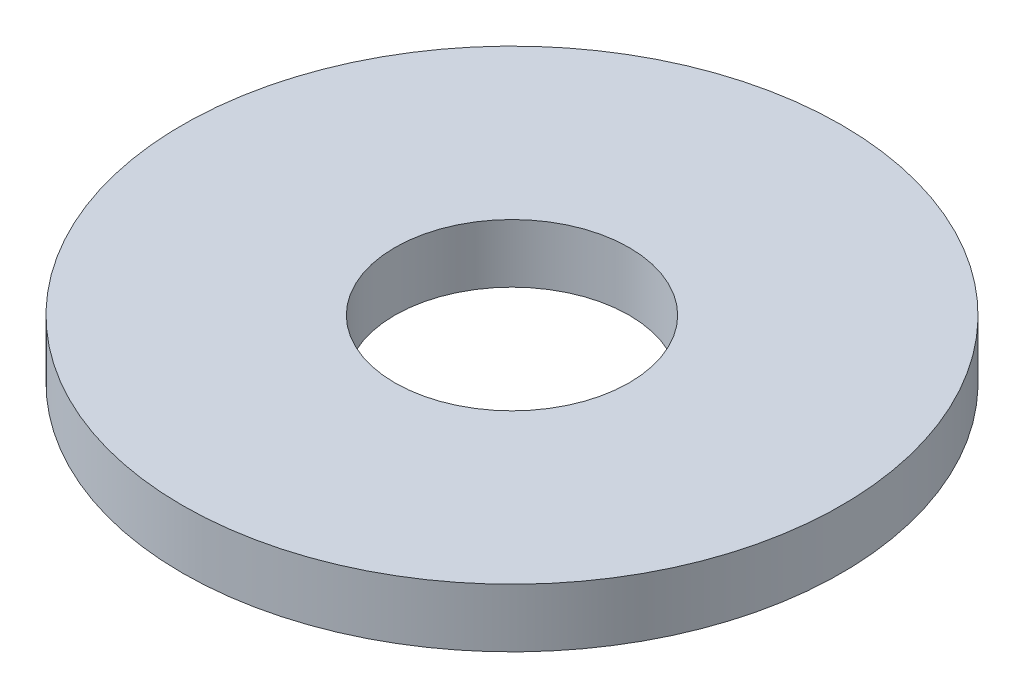
ISO-10303-21;
HEADER;
FILE_DESCRIPTION(('STEP AP214'),'2;1');
FILE_NAME('part.step','',(''),(''),'','','');
FILE_SCHEMA(('AUTOMOTIVE_DESIGN { 1 0 10303 214 1 1 1 1 }'));
ENDSEC;
DATA;
#1=APPLICATION_CONTEXT('core data for automotive mechanical design processes');
#2=APPLICATION_PROTOCOL_DEFINITION('international standard','automotive_design',2000,#1);
#3=PRODUCT_CONTEXT('',#1,'mechanical');
#4=PRODUCT('Part','Part','',(#3));
#5=PRODUCT_RELATED_PRODUCT_CATEGORY('part','',(#4));
#6=PRODUCT_DEFINITION_FORMATION('','',#4);
#7=PRODUCT_DEFINITION_CONTEXT('part definition',#1,'design');
#8=PRODUCT_DEFINITION('design','',#6,#7);
#9=PRODUCT_DEFINITION_SHAPE('','',#8);
#10=(LENGTH_UNIT() NAMED_UNIT(*) SI_UNIT(.MILLI.,.METRE.));
#11=(NAMED_UNIT(*) PLANE_ANGLE_UNIT() SI_UNIT($,.RADIAN.));
#12=(NAMED_UNIT(*) SI_UNIT($,.STERADIAN.) SOLID_ANGLE_UNIT());
#13=UNCERTAINTY_MEASURE_WITH_UNIT(LENGTH_MEASURE(1.E-05),#10,'distance_accuracy_value','');
#14=(GEOMETRIC_REPRESENTATION_CONTEXT(3) GLOBAL_UNCERTAINTY_ASSIGNED_CONTEXT((#13)) GLOBAL_UNIT_ASSIGNED_CONTEXT((#10,
#11,#12)) REPRESENTATION_CONTEXT('',''));
#15=CARTESIAN_POINT('',(0.,0.,0.));
#16=DIRECTION('',(0.,0.,1.));
#17=DIRECTION('',(1.,0.,0.));
#18=AXIS2_PLACEMENT_3D('',#15,#16,#17);
#19=CARTESIAN_POINT('',(0.,-0.8,0.));
#20=DIRECTION('',(0.,1.,0.));
#21=DIRECTION('',(0.,0.,1.));
#22=AXIS2_PLACEMENT_3D('',#19,#20,#21);
#23=PLANE('',#22);
#24=CARTESIAN_POINT('',(0.,-0.8,0.));
#25=DIRECTION('',(0.,-1.,0.));
#26=DIRECTION('',(0.,0.,-1.));
#27=AXIS2_PLACEMENT_3D('',#24,#25,#26);
#28=CIRCLE('',#27,3.2);
#29=CARTESIAN_POINT('',(0.,-0.8,-3.2));
#30=VERTEX_POINT('',#29);
#31=EDGE_CURVE('E27',#30,#30,#28,.F.);
#32=ORIENTED_EDGE('',*,*,#31,.T.);
#33=EDGE_LOOP('',(#32));
#34=FACE_BOUND('',#33,.T.);
#35=CARTESIAN_POINT('',(0.,-0.8,0.));
#36=DIRECTION('',(0.,-1.,0.));
#37=DIRECTION('',(0.,0.,-1.));
#38=AXIS2_PLACEMENT_3D('',#35,#36,#37);
#39=CIRCLE('',#38,9.);
#40=CARTESIAN_POINT('',(0.,-0.8,-9.));
#41=VERTEX_POINT('',#40);
#42=EDGE_CURVE('E18',#41,#41,#39,.F.);
#43=ORIENTED_EDGE('',*,*,#42,.F.);
#44=EDGE_LOOP('',(#43));
#45=FACE_BOUND('',#44,.T.);
#46=ADVANCED_FACE('F15',(#34,#45),#23,.F.);
#47=CARTESIAN_POINT('',(0.,0.8,0.));
#48=DIRECTION('',(0.,-1.,0.));
#49=DIRECTION('',(0.,0.,-1.));
#50=AXIS2_PLACEMENT_3D('',#47,#48,#49);
#51=CYLINDRICAL_SURFACE('',#50,9.);
#52=ORIENTED_EDGE('',*,*,#42,.T.);
#53=EDGE_LOOP('',(#52));
#54=FACE_BOUND('',#53,.T.);
#55=CARTESIAN_POINT('',(0.,0.8,0.));
#56=DIRECTION('',(0.,-1.,0.));
#57=DIRECTION('',(0.,0.,-1.));
#58=AXIS2_PLACEMENT_3D('',#55,#56,#57);
#59=CIRCLE('',#58,9.);
#60=CARTESIAN_POINT('',(0.,0.8,-9.));
#61=VERTEX_POINT('',#60);
#62=EDGE_CURVE('E22',#61,#61,#59,.F.);
#63=ORIENTED_EDGE('',*,*,#62,.F.);
#64=EDGE_LOOP('',(#63));
#65=FACE_BOUND('',#64,.T.);
#66=ADVANCED_FACE('F35',(#54,#65),#51,.T.);
#67=CARTESIAN_POINT('',(0.,0.8,0.));
#68=DIRECTION('',(0.,-1.,0.));
#69=DIRECTION('',(0.,0.,-1.));
#70=AXIS2_PLACEMENT_3D('',#67,#68,#69);
#71=CYLINDRICAL_SURFACE('',#70,3.2);
#72=CARTESIAN_POINT('',(0.,0.8,0.));
#73=DIRECTION('',(0.,-1.,0.));
#74=DIRECTION('',(0.,0.,-1.));
#75=AXIS2_PLACEMENT_3D('',#72,#73,#74);
#76=CIRCLE('',#75,3.2);
#77=CARTESIAN_POINT('',(0.,0.8,-3.2));
#78=VERTEX_POINT('',#77);
#79=EDGE_CURVE('E10',#78,#78,#76,.T.);
#80=ORIENTED_EDGE('',*,*,#79,.F.);
#81=EDGE_LOOP('',(#80));
#82=FACE_BOUND('',#81,.T.);
#83=ORIENTED_EDGE('',*,*,#31,.F.);
#84=EDGE_LOOP('',(#83));
#85=FACE_BOUND('',#84,.T.);
#86=ADVANCED_FACE('F43',(#82,#85),#71,.F.);
#87=CARTESIAN_POINT('',(0.,0.8,0.));
#88=DIRECTION('',(0.,1.,0.));
#89=DIRECTION('',(0.,0.,1.));
#90=AXIS2_PLACEMENT_3D('',#87,#88,#89);
#91=PLANE('',#90);
#92=ORIENTED_EDGE('',*,*,#79,.T.);
#93=EDGE_LOOP('',(#92));
#94=FACE_BOUND('',#93,.T.);
#95=ORIENTED_EDGE('',*,*,#62,.T.);
#96=EDGE_LOOP('',(#95));
#97=FACE_BOUND('',#96,.T.);
#98=ADVANCED_FACE('F44',(#94,#97),#91,.T.);
#99=CLOSED_SHELL('',(#46,#66,#86,#98));
#100=MANIFOLD_SOLID_BREP('B1',#99);
#101=ADVANCED_BREP_SHAPE_REPRESENTATION('',(#18,#100),#14);
#102=SHAPE_DEFINITION_REPRESENTATION(#9,#101);
ENDSEC;
END-ISO-10303-21;
